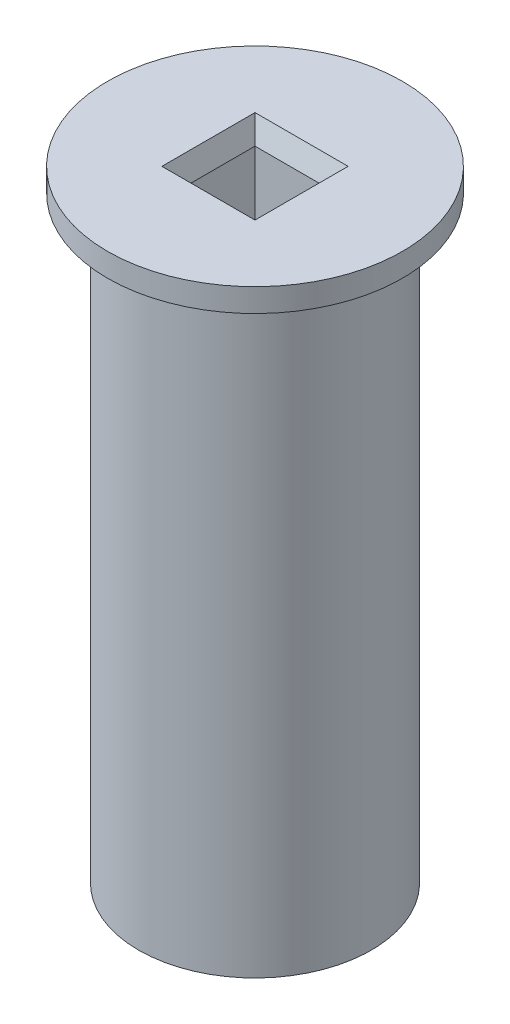
ISO-10303-21;
HEADER;
FILE_DESCRIPTION(('STEP AP214'),'2;1');
FILE_NAME('part.step','',(''),(''),'','','');
FILE_SCHEMA(('AUTOMOTIVE_DESIGN { 1 0 10303 214 1 1 1 1 }'));
ENDSEC;
DATA;
#1=APPLICATION_CONTEXT('core data for automotive mechanical design processes');
#2=APPLICATION_PROTOCOL_DEFINITION('international standard','automotive_design',2000,#1);
#3=PRODUCT_CONTEXT('',#1,'mechanical');
#4=PRODUCT('Part','Part','',(#3));
#5=PRODUCT_RELATED_PRODUCT_CATEGORY('part','',(#4));
#6=PRODUCT_DEFINITION_FORMATION('','',#4);
#7=PRODUCT_DEFINITION_CONTEXT('part definition',#1,'design');
#8=PRODUCT_DEFINITION('design','',#6,#7);
#9=PRODUCT_DEFINITION_SHAPE('','',#8);
#10=(LENGTH_UNIT() NAMED_UNIT(*) SI_UNIT(.MILLI.,.METRE.));
#11=(NAMED_UNIT(*) PLANE_ANGLE_UNIT() SI_UNIT($,.RADIAN.));
#12=(NAMED_UNIT(*) SI_UNIT($,.STERADIAN.) SOLID_ANGLE_UNIT());
#13=UNCERTAINTY_MEASURE_WITH_UNIT(LENGTH_MEASURE(1.E-05),#10,'distance_accuracy_value','');
#14=(GEOMETRIC_REPRESENTATION_CONTEXT(3) GLOBAL_UNCERTAINTY_ASSIGNED_CONTEXT((#13)) GLOBAL_UNIT_ASSIGNED_CONTEXT((#10,
#11,#12)) REPRESENTATION_CONTEXT('',''));
#15=CARTESIAN_POINT('',(0.,0.,0.));
#16=DIRECTION('',(0.,0.,1.));
#17=DIRECTION('',(1.,0.,0.));
#18=AXIS2_PLACEMENT_3D('',#15,#16,#17);
#19=CARTESIAN_POINT('',(0.,80.,0.));
#20=DIRECTION('',(0.,-1.,0.));
#21=DIRECTION('',(0.,0.,-1.));
#22=AXIS2_PLACEMENT_3D('',#19,#20,#21);
#23=CYLINDRICAL_SURFACE('',#22,15.);
#24=CARTESIAN_POINT('',(0.,0.,0.));
#25=DIRECTION('',(0.,1.,0.));
#26=DIRECTION('',(0.,0.,1.));
#27=AXIS2_PLACEMENT_3D('',#24,#25,#26);
#28=CIRCLE('',#27,15.);
#29=CARTESIAN_POINT('',(0.,0.,15.));
#30=VERTEX_POINT('',#29);
#31=EDGE_CURVE('E94',#30,#30,#28,.T.);
#32=ORIENTED_EDGE('',*,*,#31,.T.);
#33=EDGE_LOOP('',(#32));
#34=FACE_BOUND('',#33,.T.);
#35=CARTESIAN_POINT('',(0.,77.,0.));
#36=DIRECTION('',(0.,1.,0.));
#37=DIRECTION('',(0.,0.,1.));
#38=AXIS2_PLACEMENT_3D('',#35,#36,#37);
#39=CIRCLE('',#38,15.);
#40=CARTESIAN_POINT('',(0.,77.,15.));
#41=VERTEX_POINT('',#40);
#42=EDGE_CURVE('E115',#41,#41,#39,.T.);
#43=ORIENTED_EDGE('',*,*,#42,.F.);
#44=EDGE_LOOP('',(#43));
#45=FACE_BOUND('',#44,.T.);
#46=ADVANCED_FACE('F35',(#34,#45),#23,.T.);
#47=CARTESIAN_POINT('',(0.,80.,0.));
#48=DIRECTION('',(0.,1.,0.));
#49=DIRECTION('',(0.,0.,1.));
#50=AXIS2_PLACEMENT_3D('',#47,#48,#49);
#51=PLANE('',#50);
#52=DIRECTION('',(1.,0.,0.));
#53=VECTOR('',#52,1.);
#54=CARTESIAN_POINT('',(0.,80.,-5.99999999999999));
#55=LINE('',#54,#53);
#56=CARTESIAN_POINT('',(-5.99999999999999,80.,-5.99999999999999));
#57=VERTEX_POINT('',#56);
#58=CARTESIAN_POINT('',(5.99999999999999,80.,-5.99999999999999));
#59=VERTEX_POINT('',#58);
#60=EDGE_CURVE('E130',#57,#59,#55,.T.);
#61=ORIENTED_EDGE('',*,*,#60,.T.);
#62=DIRECTION('',(0.,0.,1.));
#63=VECTOR('',#62,1.);
#64=CARTESIAN_POINT('',(5.99999999999999,80.,0.));
#65=LINE('',#64,#63);
#66=CARTESIAN_POINT('',(5.99999999999999,80.,5.99999999999999));
#67=VERTEX_POINT('',#66);
#68=EDGE_CURVE('E136',#59,#67,#65,.T.);
#69=ORIENTED_EDGE('',*,*,#68,.T.);
#70=DIRECTION('',(-1.,0.,0.));
#71=VECTOR('',#70,1.);
#72=CARTESIAN_POINT('',(0.,80.,5.99999999999999));
#73=LINE('',#72,#71);
#74=CARTESIAN_POINT('',(-5.99999999999999,80.,5.99999999999999));
#75=VERTEX_POINT('',#74);
#76=EDGE_CURVE('E134',#67,#75,#73,.T.);
#77=ORIENTED_EDGE('',*,*,#76,.T.);
#78=DIRECTION('',(0.,0.,-1.));
#79=VECTOR('',#78,1.);
#80=CARTESIAN_POINT('',(-5.99999999999999,80.,0.));
#81=LINE('',#80,#79);
#82=EDGE_CURVE('E132',#75,#57,#81,.T.);
#83=ORIENTED_EDGE('',*,*,#82,.T.);
#84=EDGE_LOOP('',(#61,#69,#77,#83));
#85=FACE_BOUND('',#84,.T.);
#86=CARTESIAN_POINT('',(0.,80.,0.));
#87=DIRECTION('',(0.,1.,0.));
#88=DIRECTION('',(0.,0.,1.));
#89=AXIS2_PLACEMENT_3D('',#86,#87,#88);
#90=CIRCLE('',#89,19.);
#91=CARTESIAN_POINT('',(0.,80.,19.));
#92=VERTEX_POINT('',#91);
#93=EDGE_CURVE('E112',#92,#92,#90,.T.);
#94=ORIENTED_EDGE('',*,*,#93,.T.);
#95=EDGE_LOOP('',(#94));
#96=FACE_BOUND('',#95,.T.);
#97=ADVANCED_FACE('F157',(#85,#96),#51,.T.);
#98=CARTESIAN_POINT('',(0.,0.,0.));
#99=DIRECTION('',(0.,1.,0.));
#100=DIRECTION('',(0.,0.,1.));
#101=AXIS2_PLACEMENT_3D('',#98,#99,#100);
#102=PLANE('',#101);
#103=ORIENTED_EDGE('',*,*,#31,.F.);
#104=EDGE_LOOP('',(#103));
#105=FACE_BOUND('',#104,.T.);
#106=DIRECTION('',(0.,0.,1.));
#107=VECTOR('',#106,1.);
#108=CARTESIAN_POINT('',(-5.,0.,5.));
#109=LINE('',#108,#107);
#110=CARTESIAN_POINT('',(-5.,0.,-5.));
#111=VERTEX_POINT('',#110);
#112=CARTESIAN_POINT('',(-5.,0.,5.));
#113=VERTEX_POINT('',#112);
#114=EDGE_CURVE('E90',#111,#113,#109,.T.);
#115=ORIENTED_EDGE('',*,*,#114,.T.);
#116=DIRECTION('',(1.,0.,0.));
#117=VECTOR('',#116,1.);
#118=CARTESIAN_POINT('',(5.,0.,5.));
#119=LINE('',#118,#117);
#120=CARTESIAN_POINT('',(5.,0.,5.));
#121=VERTEX_POINT('',#120);
#122=EDGE_CURVE('E98',#113,#121,#119,.T.);
#123=ORIENTED_EDGE('',*,*,#122,.T.);
#124=DIRECTION('',(0.,0.,-1.));
#125=VECTOR('',#124,1.);
#126=CARTESIAN_POINT('',(5.,0.,5.));
#127=LINE('',#126,#125);
#128=CARTESIAN_POINT('',(5.,0.,-5.));
#129=VERTEX_POINT('',#128);
#130=EDGE_CURVE('E104',#121,#129,#127,.T.);
#131=ORIENTED_EDGE('',*,*,#130,.T.);
#132=DIRECTION('',(-1.,0.,0.));
#133=VECTOR('',#132,1.);
#134=CARTESIAN_POINT('',(5.,0.,-5.));
#135=LINE('',#134,#133);
#136=EDGE_CURVE('E108',#129,#111,#135,.T.);
#137=ORIENTED_EDGE('',*,*,#136,.T.);
#138=EDGE_LOOP('',(#115,#123,#131,#137));
#139=FACE_BOUND('',#138,.T.);
#140=ADVANCED_FACE('F106',(#105,#139),#102,.F.);
#141=CARTESIAN_POINT('',(-5.,80.,5.));
#142=DIRECTION('',(1.,0.,0.));
#143=DIRECTION('',(0.,0.,-1.));
#144=AXIS2_PLACEMENT_3D('',#141,#142,#143);
#145=PLANE('',#144);
#146=DIRECTION('',(0.,-1.,0.));
#147=VECTOR('',#146,1.);
#148=CARTESIAN_POINT('',(-5.,80.,-5.));
#149=LINE('',#148,#147);
#150=CARTESIAN_POINT('',(-5.,77.2525225805454,-5.));
#151=VERTEX_POINT('',#150);
#152=EDGE_CURVE('E120',#151,#111,#149,.T.);
#153=ORIENTED_EDGE('',*,*,#152,.F.);
#154=DIRECTION('',(0.,0.,1.));
#155=VECTOR('',#154,1.);
#156=CARTESIAN_POINT('',(-5.,77.2525225805454,5.));
#157=LINE('',#156,#155);
#158=CARTESIAN_POINT('',(-5.,77.2525225805454,5.));
#159=VERTEX_POINT('',#158);
#160=EDGE_CURVE('E44',#151,#159,#157,.T.);
#161=ORIENTED_EDGE('',*,*,#160,.T.);
#162=DIRECTION('',(0.,-1.,0.));
#163=VECTOR('',#162,1.);
#164=CARTESIAN_POINT('',(-5.,80.,5.));
#165=LINE('',#164,#163);
#166=EDGE_CURVE('E86',#159,#113,#165,.T.);
#167=ORIENTED_EDGE('',*,*,#166,.T.);
#168=ORIENTED_EDGE('',*,*,#114,.F.);
#169=EDGE_LOOP('',(#153,#161,#167,#168));
#170=FACE_BOUND('',#169,.T.);
#171=ADVANCED_FACE('F88',(#170),#145,.T.);
#172=CARTESIAN_POINT('',(5.,80.,5.));
#173=DIRECTION('',(0.,0.,-1.));
#174=DIRECTION('',(-1.,0.,0.));
#175=AXIS2_PLACEMENT_3D('',#172,#173,#174);
#176=PLANE('',#175);
#177=ORIENTED_EDGE('',*,*,#166,.F.);
#178=DIRECTION('',(1.,0.,0.));
#179=VECTOR('',#178,1.);
#180=CARTESIAN_POINT('',(5.,77.2525225805454,5.));
#181=LINE('',#180,#179);
#182=CARTESIAN_POINT('',(5.,77.2525225805454,5.));
#183=VERTEX_POINT('',#182);
#184=EDGE_CURVE('E139',#159,#183,#181,.T.);
#185=ORIENTED_EDGE('',*,*,#184,.T.);
#186=DIRECTION('',(0.,-1.,0.));
#187=VECTOR('',#186,1.);
#188=CARTESIAN_POINT('',(5.,80.,5.));
#189=LINE('',#188,#187);
#190=EDGE_CURVE('E95',#183,#121,#189,.T.);
#191=ORIENTED_EDGE('',*,*,#190,.T.);
#192=ORIENTED_EDGE('',*,*,#122,.F.);
#193=EDGE_LOOP('',(#177,#185,#191,#192));
#194=FACE_BOUND('',#193,.T.);
#195=ADVANCED_FACE('F99',(#194),#176,.T.);
#196=CARTESIAN_POINT('',(5.,80.,5.));
#197=DIRECTION('',(-1.,0.,0.));
#198=DIRECTION('',(0.,0.,1.));
#199=AXIS2_PLACEMENT_3D('',#196,#197,#198);
#200=PLANE('',#199);
#201=ORIENTED_EDGE('',*,*,#190,.F.);
#202=DIRECTION('',(0.,0.,-1.));
#203=VECTOR('',#202,1.);
#204=CARTESIAN_POINT('',(5.,77.2525225805454,5.));
#205=LINE('',#204,#203);
#206=CARTESIAN_POINT('',(5.,77.2525225805454,-5.));
#207=VERTEX_POINT('',#206);
#208=EDGE_CURVE('E127',#183,#207,#205,.T.);
#209=ORIENTED_EDGE('',*,*,#208,.T.);
#210=DIRECTION('',(0.,-1.,0.));
#211=VECTOR('',#210,1.);
#212=CARTESIAN_POINT('',(5.,80.,-5.));
#213=LINE('',#212,#211);
#214=EDGE_CURVE('E122',#207,#129,#213,.T.);
#215=ORIENTED_EDGE('',*,*,#214,.T.);
#216=ORIENTED_EDGE('',*,*,#130,.F.);
#217=EDGE_LOOP('',(#201,#209,#215,#216));
#218=FACE_BOUND('',#217,.T.);
#219=ADVANCED_FACE('F246',(#218),#200,.T.);
#220=CARTESIAN_POINT('',(5.,80.,-5.));
#221=DIRECTION('',(0.,0.,1.));
#222=DIRECTION('',(1.,0.,0.));
#223=AXIS2_PLACEMENT_3D('',#220,#221,#222);
#224=PLANE('',#223);
#225=ORIENTED_EDGE('',*,*,#214,.F.);
#226=DIRECTION('',(-1.,0.,0.));
#227=VECTOR('',#226,1.);
#228=CARTESIAN_POINT('',(5.,77.2525225805454,-5.));
#229=LINE('',#228,#227);
#230=EDGE_CURVE('E11',#207,#151,#229,.T.);
#231=ORIENTED_EDGE('',*,*,#230,.T.);
#232=ORIENTED_EDGE('',*,*,#152,.T.);
#233=ORIENTED_EDGE('',*,*,#136,.F.);
#234=EDGE_LOOP('',(#225,#231,#232,#233));
#235=FACE_BOUND('',#234,.T.);
#236=ADVANCED_FACE('F170',(#235),#224,.T.);
#237=CARTESIAN_POINT('',(0.,77.,0.));
#238=DIRECTION('',(0.,1.,0.));
#239=DIRECTION('',(0.,0.,1.));
#240=AXIS2_PLACEMENT_3D('',#237,#238,#239);
#241=PLANE('',#240);
#242=CARTESIAN_POINT('',(0.,77.,0.));
#243=DIRECTION('',(0.,1.,0.));
#244=DIRECTION('',(0.,0.,1.));
#245=AXIS2_PLACEMENT_3D('',#242,#243,#244);
#246=CIRCLE('',#245,19.);
#247=CARTESIAN_POINT('',(0.,77.,19.));
#248=VERTEX_POINT('',#247);
#249=EDGE_CURVE('E109',#248,#248,#246,.T.);
#250=ORIENTED_EDGE('',*,*,#249,.F.);
#251=EDGE_LOOP('',(#250));
#252=FACE_BOUND('',#251,.T.);
#253=ORIENTED_EDGE('',*,*,#42,.T.);
#254=EDGE_LOOP('',(#253));
#255=FACE_BOUND('',#254,.T.);
#256=ADVANCED_FACE('F161',(#252,#255),#241,.F.);
#257=CARTESIAN_POINT('',(0.,77.,0.));
#258=DIRECTION('',(0.,1.,0.));
#259=DIRECTION('',(0.,0.,1.));
#260=AXIS2_PLACEMENT_3D('',#257,#258,#259);
#261=CYLINDRICAL_SURFACE('',#260,19.);
#262=ORIENTED_EDGE('',*,*,#249,.T.);
#263=EDGE_LOOP('',(#262));
#264=FACE_BOUND('',#263,.T.);
#265=ORIENTED_EDGE('',*,*,#93,.F.);
#266=EDGE_LOOP('',(#265));
#267=FACE_BOUND('',#266,.T.);
#268=ADVANCED_FACE('F159',(#264,#267),#261,.T.);
#269=CARTESIAN_POINT('',(-5.,77.2525225805454,5.));
#270=DIRECTION('',(-0.939692620785909,-0.342020143325667,0.));
#271=DIRECTION('',(0.,0.,1.));
#272=AXIS2_PLACEMENT_3D('',#269,#270,#271);
#273=PLANE('',#272);
#274=DIRECTION('',(0.323615577118183,-0.889126490715989,0.323615577118183));
#275=VECTOR('',#274,1.);
#276=CARTESIAN_POINT('',(-3.95272958246465,74.3751707563042,-3.95272958246465));
#277=LINE('',#276,#275);
#278=EDGE_CURVE('E145',#57,#151,#277,.T.);
#279=ORIENTED_EDGE('',*,*,#278,.F.);
#280=ORIENTED_EDGE('',*,*,#82,.F.);
#281=DIRECTION('',(0.323615577118183,-0.889126490715989,-0.323615577118183));
#282=VECTOR('',#281,1.);
#283=CARTESIAN_POINT('',(-3.95272958246465,74.3751707563042,3.95272958246465));
#284=LINE('',#283,#282);
#285=EDGE_CURVE('E39',#159,#75,#284,.F.);
#286=ORIENTED_EDGE('',*,*,#285,.F.);
#287=ORIENTED_EDGE('',*,*,#160,.F.);
#288=EDGE_LOOP('',(#279,#280,#286,#287));
#289=FACE_BOUND('',#288,.T.);
#290=ADVANCED_FACE('F37',(#289),#273,.F.);
#291=CARTESIAN_POINT('',(5.,77.2525225805454,5.));
#292=DIRECTION('',(0.,-0.342020143325667,0.939692620785909));
#293=DIRECTION('',(1.,0.,0.));
#294=AXIS2_PLACEMENT_3D('',#291,#292,#293);
#295=PLANE('',#294);
#296=ORIENTED_EDGE('',*,*,#285,.T.);
#297=ORIENTED_EDGE('',*,*,#76,.F.);
#298=DIRECTION('',(-0.323615577118183,-0.889126490715989,-0.323615577118183));
#299=VECTOR('',#298,1.);
#300=CARTESIAN_POINT('',(5.,77.2525225805454,5.));
#301=LINE('',#300,#299);
#302=EDGE_CURVE('E144',#183,#67,#301,.F.);
#303=ORIENTED_EDGE('',*,*,#302,.F.);
#304=ORIENTED_EDGE('',*,*,#184,.F.);
#305=EDGE_LOOP('',(#296,#297,#303,#304));
#306=FACE_BOUND('',#305,.T.);
#307=ADVANCED_FACE('F168',(#306),#295,.F.);
#308=CARTESIAN_POINT('',(5.,77.2525225805454,-5.));
#309=DIRECTION('',(0.,-0.342020143325667,-0.939692620785909));
#310=DIRECTION('',(-1.,0.,0.));
#311=AXIS2_PLACEMENT_3D('',#308,#309,#310);
#312=PLANE('',#311);
#313=ORIENTED_EDGE('',*,*,#278,.T.);
#314=ORIENTED_EDGE('',*,*,#230,.F.);
#315=DIRECTION('',(0.323615577118183,0.889126490715989,-0.323615577118183));
#316=VECTOR('',#315,1.);
#317=CARTESIAN_POINT('',(3.95272958246465,74.3751707563042,-3.95272958246465));
#318=LINE('',#317,#316);
#319=EDGE_CURVE('E142',#59,#207,#318,.F.);
#320=ORIENTED_EDGE('',*,*,#319,.F.);
#321=ORIENTED_EDGE('',*,*,#60,.F.);
#322=EDGE_LOOP('',(#313,#314,#320,#321));
#323=FACE_BOUND('',#322,.T.);
#324=ADVANCED_FACE('F188',(#323),#312,.F.);
#325=CARTESIAN_POINT('',(5.,77.2525225805454,5.));
#326=DIRECTION('',(0.939692620785909,-0.342020143325667,0.));
#327=DIRECTION('',(0.,0.,-1.));
#328=AXIS2_PLACEMENT_3D('',#325,#326,#327);
#329=PLANE('',#328);
#330=ORIENTED_EDGE('',*,*,#302,.T.);
#331=ORIENTED_EDGE('',*,*,#68,.F.);
#332=ORIENTED_EDGE('',*,*,#319,.T.);
#333=ORIENTED_EDGE('',*,*,#208,.F.);
#334=EDGE_LOOP('',(#330,#331,#332,#333));
#335=FACE_BOUND('',#334,.T.);
#336=ADVANCED_FACE('F185',(#335),#329,.F.);
#337=CLOSED_SHELL('',(#46,#97,#140,#171,#195,#219,#236,#256,#268,#290,#307,#324,#336));
#338=MANIFOLD_SOLID_BREP('B2',#337);
#339=ADVANCED_BREP_SHAPE_REPRESENTATION('',(#18,#338),#14);
#340=SHAPE_DEFINITION_REPRESENTATION(#9,#339);
ENDSEC;
END-ISO-10303-21;
